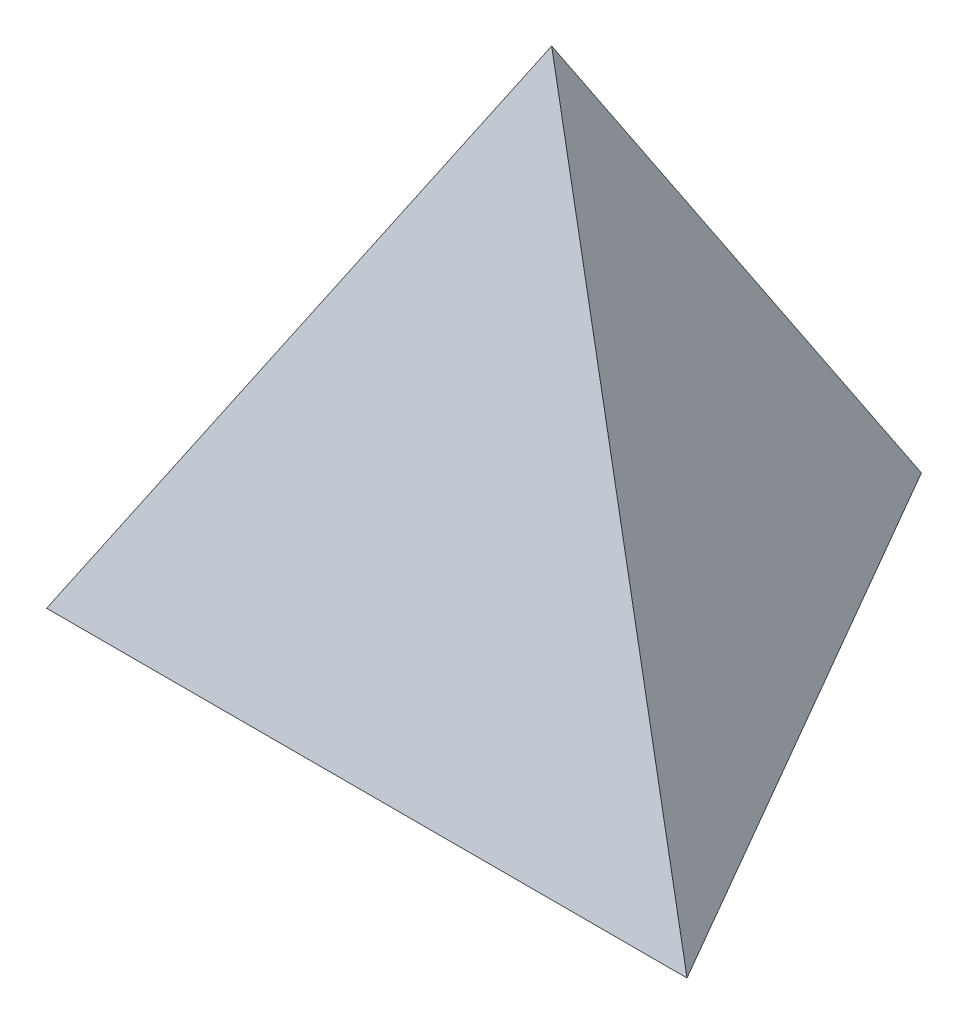
ISO-10303-21;
HEADER;
FILE_DESCRIPTION(('STEP AP214'),'2;1');
FILE_NAME('part.step','',(''),(''),'','','');
FILE_SCHEMA(('AUTOMOTIVE_DESIGN { 1 0 10303 214 1 1 1 1 }'));
ENDSEC;
DATA;
#1=APPLICATION_CONTEXT('core data for automotive mechanical design processes');
#2=APPLICATION_PROTOCOL_DEFINITION('international standard','automotive_design',2000,#1);
#3=PRODUCT_CONTEXT('',#1,'mechanical');
#4=PRODUCT('Part','Part','',(#3));
#5=PRODUCT_RELATED_PRODUCT_CATEGORY('part','',(#4));
#6=PRODUCT_DEFINITION_FORMATION('','',#4);
#7=PRODUCT_DEFINITION_CONTEXT('part definition',#1,'design');
#8=PRODUCT_DEFINITION('design','',#6,#7);
#9=PRODUCT_DEFINITION_SHAPE('','',#8);
#10=(LENGTH_UNIT() NAMED_UNIT(*) SI_UNIT(.MILLI.,.METRE.));
#11=(NAMED_UNIT(*) PLANE_ANGLE_UNIT() SI_UNIT($,.RADIAN.));
#12=(NAMED_UNIT(*) SI_UNIT($,.STERADIAN.) SOLID_ANGLE_UNIT());
#13=UNCERTAINTY_MEASURE_WITH_UNIT(LENGTH_MEASURE(1.E-05),#10,'distance_accuracy_value','');
#14=(GEOMETRIC_REPRESENTATION_CONTEXT(3) GLOBAL_UNCERTAINTY_ASSIGNED_CONTEXT((#13)) GLOBAL_UNIT_ASSIGNED_CONTEXT((#10,
#11,#12)) REPRESENTATION_CONTEXT('',''));
#15=CARTESIAN_POINT('',(0.,0.,0.));
#16=DIRECTION('',(0.,0.,1.));
#17=DIRECTION('',(1.,0.,0.));
#18=AXIS2_PLACEMENT_3D('',#15,#16,#17);
#19=CARTESIAN_POINT('',(-9.89867036525613,3.81,-5.715));
#20=DIRECTION('',(0.821583836257749,-0.316227766016838,0.474341649025257));
#21=DIRECTION('',(0.5,0.,-0.866025403784439));
#22=AXIS2_PLACEMENT_3D('',#19,#20,#21);
#23=PLANE('',#22);
#24=DIRECTION('',(0.,-0.832050294337844,-0.554700196225229));
#25=VECTOR('',#24,1.);
#26=CARTESIAN_POINT('',(0.,11.7230769230769,-17.5846153846154));
#27=LINE('',#26,#25);
#28=CARTESIAN_POINT('',(0.,38.1,0.));
#29=VERTEX_POINT('',#28);
#30=CARTESIAN_POINT('',(0.,2.1316282072803E-11,-25.3999999999858));
#31=VERTEX_POINT('',#30);
#32=EDGE_CURVE('E65',#29,#31,#27,.T.);
#33=ORIENTED_EDGE('',*,*,#32,.T.);
#34=DIRECTION('',(-0.5,0.,0.866025403784439));
#35=VECTOR('',#34,1.);
#36=CARTESIAN_POINT('',(-10.9985226280624,0.,-6.35));
#37=LINE('',#36,#35);
#38=CARTESIAN_POINT('',(-21.9970452561083,2.8421709430404E-11,12.6999999999905));
#39=VERTEX_POINT('',#38);
#40=EDGE_CURVE('E69',#31,#39,#37,.T.);
#41=ORIENTED_EDGE('',*,*,#40,.T.);
#42=DIRECTION('',(0.480384461415261,0.832050294337844,-0.277350098112615));
#43=VECTOR('',#42,1.);
#44=CARTESIAN_POINT('',(-15.2287236388556,11.7230769230769,8.7923076923077));
#45=LINE('',#44,#43);
#46=EDGE_CURVE('E71',#39,#29,#45,.T.);
#47=ORIENTED_EDGE('',*,*,#46,.T.);
#48=EDGE_LOOP('',(#33,#41,#47));
#49=FACE_BOUND('',#48,.T.);
#50=ADVANCED_FACE('F42',(#49),#23,.F.);
#51=CARTESIAN_POINT('',(0.,0.,0.));
#52=DIRECTION('',(0.,1.,0.));
#53=DIRECTION('',(0.,0.,1.));
#54=AXIS2_PLACEMENT_3D('',#51,#52,#53);
#55=PLANE('',#54);
#56=DIRECTION('',(0.5,0.,0.866025403784439));
#57=VECTOR('',#56,1.);
#58=CARTESIAN_POINT('',(10.9985226280624,0.,-6.35));
#59=LINE('',#58,#57);
#60=CARTESIAN_POINT('',(21.9970452561083,2.8421709430404E-11,12.6999999999905));
#61=VERTEX_POINT('',#60);
#62=EDGE_CURVE('E12',#31,#61,#59,.T.);
#63=ORIENTED_EDGE('',*,*,#62,.T.);
#64=DIRECTION('',(1.,0.,0.));
#65=VECTOR('',#64,1.);
#66=CARTESIAN_POINT('',(0.,0.,12.7));
#67=LINE('',#66,#65);
#68=EDGE_CURVE('E46',#39,#61,#67,.T.);
#69=ORIENTED_EDGE('',*,*,#68,.F.);
#70=ORIENTED_EDGE('',*,*,#40,.F.);
#71=EDGE_LOOP('',(#63,#69,#70));
#72=FACE_BOUND('',#71,.T.);
#73=ADVANCED_FACE('F73',(#72),#55,.F.);
#74=CARTESIAN_POINT('',(0.,3.81,11.43));
#75=DIRECTION('',(0.,-0.316227766016838,-0.948683298050514));
#76=DIRECTION('',(0.,0.948683298050514,-0.316227766016838));
#77=AXIS2_PLACEMENT_3D('',#74,#75,#76);
#78=PLANE('',#77);
#79=DIRECTION('',(-0.480384461415261,0.832050294337844,-0.277350098112615));
#80=VECTOR('',#79,1.);
#81=CARTESIAN_POINT('',(15.2287236388556,11.7230769230769,8.79230769230769));
#82=LINE('',#81,#80);
#83=EDGE_CURVE('E51',#61,#29,#82,.T.);
#84=ORIENTED_EDGE('',*,*,#83,.T.);
#85=ORIENTED_EDGE('',*,*,#46,.F.);
#86=ORIENTED_EDGE('',*,*,#68,.T.);
#87=EDGE_LOOP('',(#84,#85,#86));
#88=FACE_BOUND('',#87,.T.);
#89=ADVANCED_FACE('F76',(#88),#78,.F.);
#90=CARTESIAN_POINT('',(9.89867036525614,3.81,-5.715));
#91=DIRECTION('',(0.821583836257749,0.316227766016838,-0.474341649025257));
#92=DIRECTION('',(-0.5,0.,-0.866025403784439));
#93=AXIS2_PLACEMENT_3D('',#90,#91,#92);
#94=PLANE('',#93);
#95=ORIENTED_EDGE('',*,*,#62,.F.);
#96=ORIENTED_EDGE('',*,*,#32,.F.);
#97=ORIENTED_EDGE('',*,*,#83,.F.);
#98=EDGE_LOOP('',(#95,#96,#97));
#99=FACE_BOUND('',#98,.T.);
#100=ADVANCED_FACE('F44',(#99),#94,.T.);
#101=CLOSED_SHELL('',(#50,#73,#89,#100));
#102=MANIFOLD_SOLID_BREP('B2',#101);
#103=ADVANCED_BREP_SHAPE_REPRESENTATION('',(#18,#102),#14);
#104=SHAPE_DEFINITION_REPRESENTATION(#9,#103);
ENDSEC;
END-ISO-10303-21;
